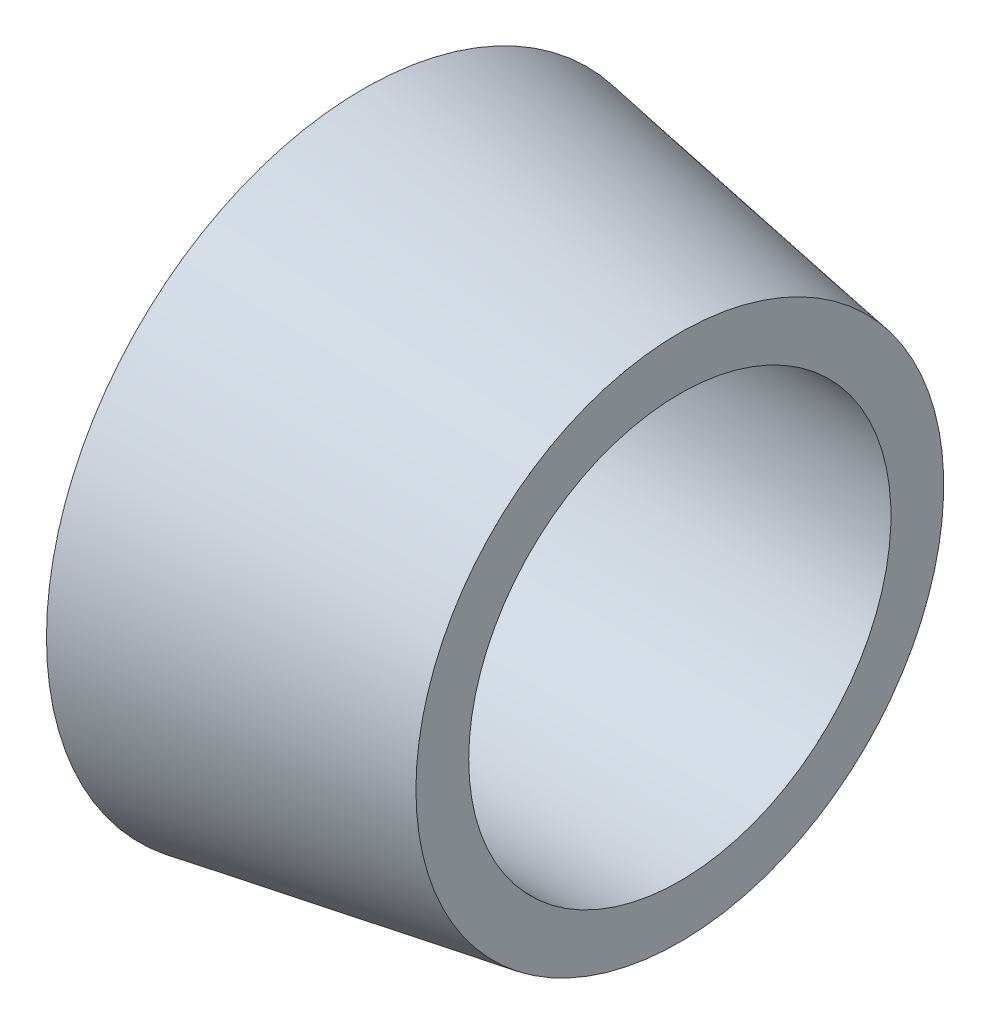
ISO-10303-21;
HEADER;
FILE_DESCRIPTION(('STEP AP214'),'2;1');
FILE_NAME('part.step','',(''),(''),'','','');
FILE_SCHEMA(('AUTOMOTIVE_DESIGN { 1 0 10303 214 1 1 1 1 }'));
ENDSEC;
DATA;
#1=APPLICATION_CONTEXT('core data for automotive mechanical design processes');
#2=APPLICATION_PROTOCOL_DEFINITION('international standard','automotive_design',2000,#1);
#3=PRODUCT_CONTEXT('',#1,'mechanical');
#4=PRODUCT('Part','Part','',(#3));
#5=PRODUCT_RELATED_PRODUCT_CATEGORY('part','',(#4));
#6=PRODUCT_DEFINITION_FORMATION('','',#4);
#7=PRODUCT_DEFINITION_CONTEXT('part definition',#1,'design');
#8=PRODUCT_DEFINITION('design','',#6,#7);
#9=PRODUCT_DEFINITION_SHAPE('','',#8);
#10=(LENGTH_UNIT() NAMED_UNIT(*) SI_UNIT(.MILLI.,.METRE.));
#11=(NAMED_UNIT(*) PLANE_ANGLE_UNIT() SI_UNIT($,.RADIAN.));
#12=(NAMED_UNIT(*) SI_UNIT($,.STERADIAN.) SOLID_ANGLE_UNIT());
#13=UNCERTAINTY_MEASURE_WITH_UNIT(LENGTH_MEASURE(1.E-05),#10,'distance_accuracy_value','');
#14=(GEOMETRIC_REPRESENTATION_CONTEXT(3) GLOBAL_UNCERTAINTY_ASSIGNED_CONTEXT((#13)) GLOBAL_UNIT_ASSIGNED_CONTEXT((#10,
#11,#12)) REPRESENTATION_CONTEXT('',''));
#15=CARTESIAN_POINT('',(0.,0.,0.));
#16=DIRECTION('',(0.,0.,1.));
#17=DIRECTION('',(1.,0.,0.));
#18=AXIS2_PLACEMENT_3D('',#15,#16,#17);
#19=CARTESIAN_POINT('',(0.,0.,0.));
#20=DIRECTION('',(-1.,0.,0.));
#21=DIRECTION('',(0.,0.,1.));
#22=AXIS2_PLACEMENT_3D('',#19,#20,#21);
#23=CYLINDRICAL_SURFACE('',#22,4.);
#24=CARTESIAN_POINT('',(6.,0.,0.));
#25=DIRECTION('',(-1.,0.,0.));
#26=DIRECTION('',(0.,0.,1.));
#27=AXIS2_PLACEMENT_3D('',#24,#25,#26);
#28=CIRCLE('',#27,4.);
#29=CARTESIAN_POINT('',(6.,0.,4.));
#30=VERTEX_POINT('',#29);
#31=EDGE_CURVE('E46',#30,#30,#28,.T.);
#32=ORIENTED_EDGE('',*,*,#31,.F.);
#33=EDGE_LOOP('',(#32));
#34=FACE_BOUND('',#33,.T.);
#35=CARTESIAN_POINT('',(0.,0.,0.));
#36=DIRECTION('',(-1.,0.,0.));
#37=DIRECTION('',(0.,0.,1.));
#38=AXIS2_PLACEMENT_3D('',#35,#36,#37);
#39=CIRCLE('',#38,4.);
#40=CARTESIAN_POINT('',(0.,0.,4.));
#41=VERTEX_POINT('',#40);
#42=EDGE_CURVE('E10',#41,#41,#39,.T.);
#43=ORIENTED_EDGE('',*,*,#42,.T.);
#44=EDGE_LOOP('',(#43));
#45=FACE_BOUND('',#44,.T.);
#46=ADVANCED_FACE('F32',(#34,#45),#23,.F.);
#47=CARTESIAN_POINT('',(0.,4.,0.));
#48=DIRECTION('',(1.,0.,0.));
#49=DIRECTION('',(0.,0.,-1.));
#50=AXIS2_PLACEMENT_3D('',#47,#48,#49);
#51=PLANE('',#50);
#52=ORIENTED_EDGE('',*,*,#42,.F.);
#53=EDGE_LOOP('',(#52));
#54=FACE_BOUND('',#53,.T.);
#55=CARTESIAN_POINT('',(0.,0.,0.));
#56=DIRECTION('',(-1.,0.,0.));
#57=DIRECTION('',(0.,0.,1.));
#58=AXIS2_PLACEMENT_3D('',#55,#56,#57);
#59=CIRCLE('',#58,6.);
#60=CARTESIAN_POINT('',(0.,0.,6.));
#61=VERTEX_POINT('',#60);
#62=EDGE_CURVE('E38',#61,#61,#59,.T.);
#63=ORIENTED_EDGE('',*,*,#62,.T.);
#64=EDGE_LOOP('',(#63));
#65=FACE_BOUND('',#64,.T.);
#66=ADVANCED_FACE('F55',(#54,#65),#51,.F.);
#67=CARTESIAN_POINT('',(6.,0.,0.));
#68=DIRECTION('',(-1.,0.,0.));
#69=DIRECTION('',(0.,0.,1.));
#70=AXIS2_PLACEMENT_3D('',#67,#68,#69);
#71=CONICAL_SURFACE('',#70,5.,0.165148677414627);
#72=ORIENTED_EDGE('',*,*,#62,.F.);
#73=EDGE_LOOP('',(#72));
#74=FACE_BOUND('',#73,.T.);
#75=CARTESIAN_POINT('',(6.,0.,0.));
#76=DIRECTION('',(-1.,0.,0.));
#77=DIRECTION('',(0.,0.,1.));
#78=AXIS2_PLACEMENT_3D('',#75,#76,#77);
#79=CIRCLE('',#78,5.);
#80=CARTESIAN_POINT('',(6.,0.,5.));
#81=VERTEX_POINT('',#80);
#82=EDGE_CURVE('E42',#81,#81,#79,.T.);
#83=ORIENTED_EDGE('',*,*,#82,.T.);
#84=EDGE_LOOP('',(#83));
#85=FACE_BOUND('',#84,.T.);
#86=ADVANCED_FACE('F59',(#74,#85),#71,.T.);
#87=CARTESIAN_POINT('',(6.,5.,0.));
#88=DIRECTION('',(-1.,0.,0.));
#89=DIRECTION('',(0.,0.,1.));
#90=AXIS2_PLACEMENT_3D('',#87,#88,#89);
#91=PLANE('',#90);
#92=ORIENTED_EDGE('',*,*,#82,.F.);
#93=EDGE_LOOP('',(#92));
#94=FACE_BOUND('',#93,.T.);
#95=ORIENTED_EDGE('',*,*,#31,.T.);
#96=EDGE_LOOP('',(#95));
#97=FACE_BOUND('',#96,.T.);
#98=ADVANCED_FACE('F52',(#94,#97),#91,.F.);
#99=CLOSED_SHELL('',(#46,#66,#86,#98));
#100=MANIFOLD_SOLID_BREP('B2',#99);
#101=ADVANCED_BREP_SHAPE_REPRESENTATION('',(#18,#100),#14);
#102=SHAPE_DEFINITION_REPRESENTATION(#9,#101);
ENDSEC;
END-ISO-10303-21;
